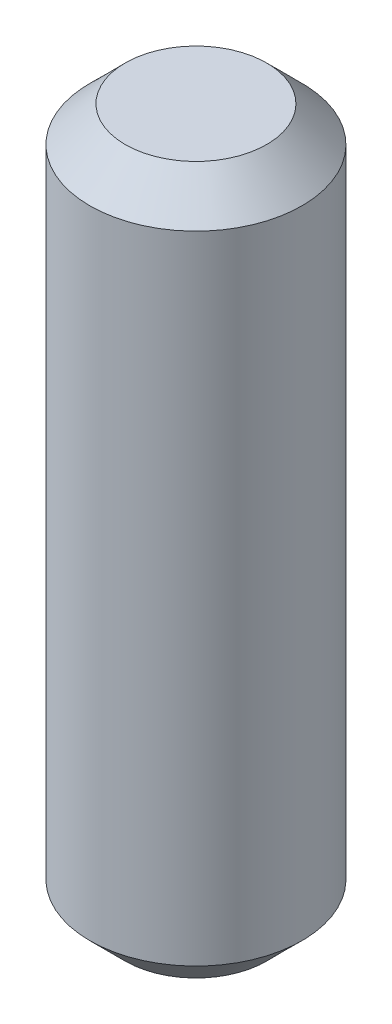
ISO-10303-21;
HEADER;
FILE_DESCRIPTION(('STEP AP214'),'2;1');
FILE_NAME('part.step','',(''),(''),'','','');
FILE_SCHEMA(('AUTOMOTIVE_DESIGN { 1 0 10303 214 1 1 1 1 }'));
ENDSEC;
DATA;
#1=APPLICATION_CONTEXT('core data for automotive mechanical design processes');
#2=APPLICATION_PROTOCOL_DEFINITION('international standard','automotive_design',2000,#1);
#3=PRODUCT_CONTEXT('',#1,'mechanical');
#4=PRODUCT('Part','Part','',(#3));
#5=PRODUCT_RELATED_PRODUCT_CATEGORY('part','',(#4));
#6=PRODUCT_DEFINITION_FORMATION('','',#4);
#7=PRODUCT_DEFINITION_CONTEXT('part definition',#1,'design');
#8=PRODUCT_DEFINITION('design','',#6,#7);
#9=PRODUCT_DEFINITION_SHAPE('','',#8);
#10=(LENGTH_UNIT() NAMED_UNIT(*) SI_UNIT(.MILLI.,.METRE.));
#11=(NAMED_UNIT(*) PLANE_ANGLE_UNIT() SI_UNIT($,.RADIAN.));
#12=(NAMED_UNIT(*) SI_UNIT($,.STERADIAN.) SOLID_ANGLE_UNIT());
#13=UNCERTAINTY_MEASURE_WITH_UNIT(LENGTH_MEASURE(1.E-05),#10,'distance_accuracy_value','');
#14=(GEOMETRIC_REPRESENTATION_CONTEXT(3) GLOBAL_UNCERTAINTY_ASSIGNED_CONTEXT((#13)) GLOBAL_UNIT_ASSIGNED_CONTEXT((#10,
#11,#12)) REPRESENTATION_CONTEXT('',''));
#15=CARTESIAN_POINT('',(0.,0.,0.));
#16=DIRECTION('',(0.,0.,1.));
#17=DIRECTION('',(1.,0.,0.));
#18=AXIS2_PLACEMENT_3D('',#15,#16,#17);
#19=CARTESIAN_POINT('',(0.,10.,0.));
#20=DIRECTION('',(0.,-1.,0.));
#21=DIRECTION('',(0.,0.,-1.));
#22=AXIS2_PLACEMENT_3D('',#19,#20,#21);
#23=CYLINDRICAL_SURFACE('',#22,1.5);
#24=CARTESIAN_POINT('',(0.,0.5,0.));
#25=DIRECTION('',(0.,1.,0.));
#26=DIRECTION('',(0.,0.,1.));
#27=AXIS2_PLACEMENT_3D('',#24,#25,#26);
#28=CIRCLE('',#27,1.5);
#29=CARTESIAN_POINT('',(0.,0.5,1.5));
#30=VERTEX_POINT('',#29);
#31=EDGE_CURVE('E46',#30,#30,#28,.T.);
#32=ORIENTED_EDGE('',*,*,#31,.T.);
#33=EDGE_LOOP('',(#32));
#34=FACE_BOUND('',#33,.T.);
#35=CARTESIAN_POINT('',(0.,9.5,0.));
#36=DIRECTION('',(0.,1.,0.));
#37=DIRECTION('',(0.,0.,1.));
#38=AXIS2_PLACEMENT_3D('',#35,#36,#37);
#39=CIRCLE('',#38,1.5);
#40=CARTESIAN_POINT('',(0.,9.5,1.5));
#41=VERTEX_POINT('',#40);
#42=EDGE_CURVE('E50',#41,#41,#39,.F.);
#43=ORIENTED_EDGE('',*,*,#42,.T.);
#44=EDGE_LOOP('',(#43));
#45=FACE_BOUND('',#44,.T.);
#46=ADVANCED_FACE('F34',(#34,#45),#23,.T.);
#47=CARTESIAN_POINT('',(0.,10.,0.));
#48=DIRECTION('',(0.,1.,0.));
#49=DIRECTION('',(0.,0.,1.));
#50=AXIS2_PLACEMENT_3D('',#47,#48,#49);
#51=PLANE('',#50);
#52=CARTESIAN_POINT('',(0.,10.,0.));
#53=DIRECTION('',(0.,1.,0.));
#54=DIRECTION('',(0.,0.,1.));
#55=AXIS2_PLACEMENT_3D('',#52,#53,#54);
#56=CIRCLE('',#55,1.);
#57=CARTESIAN_POINT('',(0.,10.,1.));
#58=VERTEX_POINT('',#57);
#59=EDGE_CURVE('E10',#58,#58,#56,.T.);
#60=ORIENTED_EDGE('',*,*,#59,.T.);
#61=EDGE_LOOP('',(#60));
#62=FACE_BOUND('',#61,.T.);
#63=ADVANCED_FACE('F66',(#62),#51,.T.);
#64=CARTESIAN_POINT('',(0.,0.,0.));
#65=DIRECTION('',(0.,1.,0.));
#66=DIRECTION('',(0.,0.,1.));
#67=AXIS2_PLACEMENT_3D('',#64,#65,#66);
#68=PLANE('',#67);
#69=CARTESIAN_POINT('',(0.,0.,0.));
#70=DIRECTION('',(0.,1.,0.));
#71=DIRECTION('',(0.,0.,1.));
#72=AXIS2_PLACEMENT_3D('',#69,#70,#71);
#73=CIRCLE('',#72,0.999999999999999);
#74=CARTESIAN_POINT('',(0.,0.,0.999999999999999));
#75=VERTEX_POINT('',#74);
#76=EDGE_CURVE('E42',#75,#75,#73,.F.);
#77=ORIENTED_EDGE('',*,*,#76,.T.);
#78=EDGE_LOOP('',(#77));
#79=FACE_BOUND('',#78,.T.);
#80=ADVANCED_FACE('F63',(#79),#68,.F.);
#81=CARTESIAN_POINT('',(0.,0.5,0.));
#82=DIRECTION('',(0.,1.,0.));
#83=DIRECTION('',(0.,0.,1.));
#84=AXIS2_PLACEMENT_3D('',#81,#82,#83);
#85=CONICAL_SURFACE('',#84,1.5,0.78539816339745);
#86=ORIENTED_EDGE('',*,*,#76,.F.);
#87=EDGE_LOOP('',(#86));
#88=FACE_BOUND('',#87,.T.);
#89=ORIENTED_EDGE('',*,*,#31,.F.);
#90=EDGE_LOOP('',(#89));
#91=FACE_BOUND('',#90,.T.);
#92=ADVANCED_FACE('F59',(#88,#91),#85,.T.);
#93=CARTESIAN_POINT('',(0.,10.,0.));
#94=DIRECTION('',(0.,-1.,0.));
#95=DIRECTION('',(0.,0.,-1.));
#96=AXIS2_PLACEMENT_3D('',#93,#94,#95);
#97=CONICAL_SURFACE('',#96,1.,0.785398163397447);
#98=ORIENTED_EDGE('',*,*,#42,.F.);
#99=EDGE_LOOP('',(#98));
#100=FACE_BOUND('',#99,.T.);
#101=ORIENTED_EDGE('',*,*,#59,.F.);
#102=EDGE_LOOP('',(#101));
#103=FACE_BOUND('',#102,.T.);
#104=ADVANCED_FACE('F37',(#100,#103),#97,.T.);
#105=CLOSED_SHELL('',(#46,#63,#80,#92,#104));
#106=MANIFOLD_SOLID_BREP('B2',#105);
#107=ADVANCED_BREP_SHAPE_REPRESENTATION('',(#18,#106),#14);
#108=SHAPE_DEFINITION_REPRESENTATION(#9,#107);
ENDSEC;
END-ISO-10303-21;
